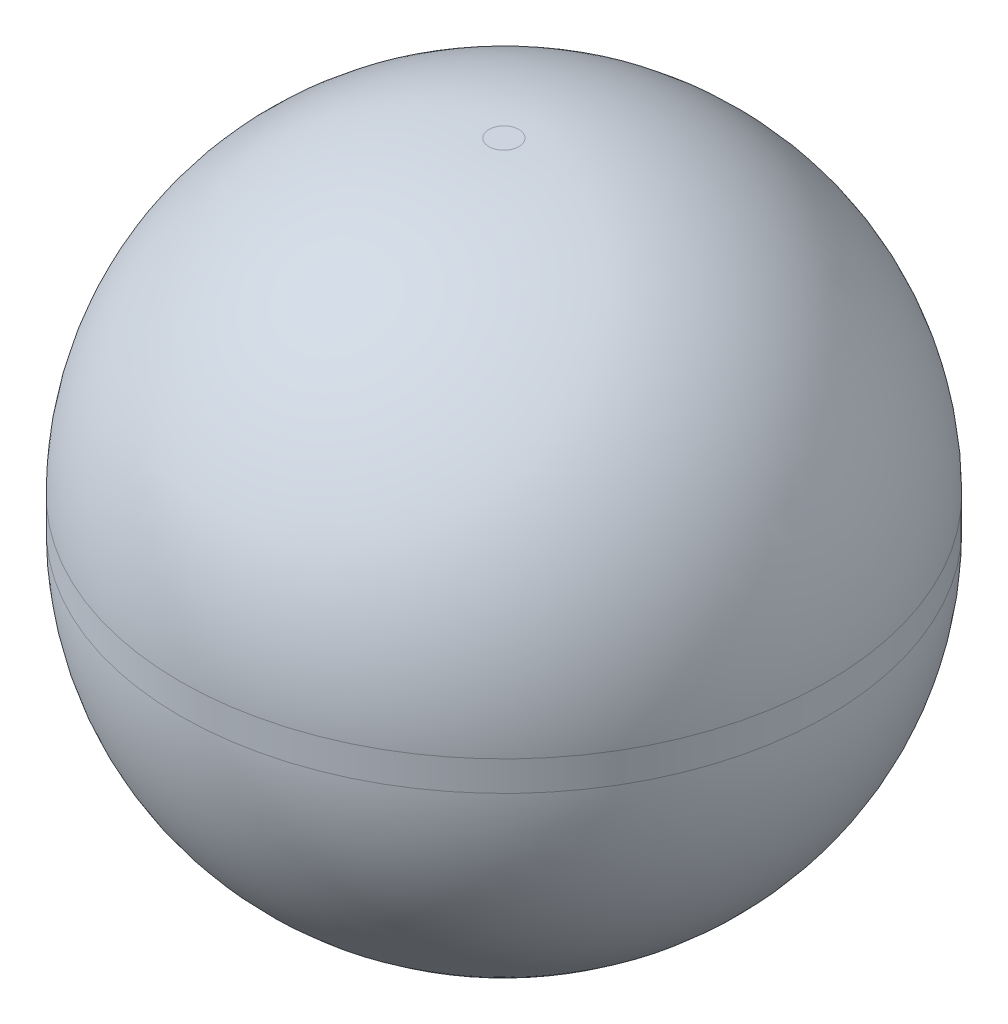
ISO-10303-21;
HEADER;
FILE_DESCRIPTION(('STEP AP214'),'2;1');
FILE_NAME('part.step','',(''),(''),'','','');
FILE_SCHEMA(('AUTOMOTIVE_DESIGN { 1 0 10303 214 1 1 1 1 }'));
ENDSEC;
DATA;
#1=APPLICATION_CONTEXT('core data for automotive mechanical design processes');
#2=APPLICATION_PROTOCOL_DEFINITION('international standard','automotive_design',2000,#1);
#3=PRODUCT_CONTEXT('',#1,'mechanical');
#4=PRODUCT('Part','Part','',(#3));
#5=PRODUCT_RELATED_PRODUCT_CATEGORY('part','',(#4));
#6=PRODUCT_DEFINITION_FORMATION('','',#4);
#7=PRODUCT_DEFINITION_CONTEXT('part definition',#1,'design');
#8=PRODUCT_DEFINITION('design','',#6,#7);
#9=PRODUCT_DEFINITION_SHAPE('','',#8);
#10=(LENGTH_UNIT() NAMED_UNIT(*) SI_UNIT(.MILLI.,.METRE.));
#11=(NAMED_UNIT(*) PLANE_ANGLE_UNIT() SI_UNIT($,.RADIAN.));
#12=(NAMED_UNIT(*) SI_UNIT($,.STERADIAN.) SOLID_ANGLE_UNIT());
#13=UNCERTAINTY_MEASURE_WITH_UNIT(LENGTH_MEASURE(1.E-05),#10,'distance_accuracy_value','');
#14=(GEOMETRIC_REPRESENTATION_CONTEXT(3) GLOBAL_UNCERTAINTY_ASSIGNED_CONTEXT((#13)) GLOBAL_UNIT_ASSIGNED_CONTEXT((#10,
#11,#12)) REPRESENTATION_CONTEXT('',''));
#15=CARTESIAN_POINT('',(0.,0.,0.));
#16=DIRECTION('',(0.,0.,1.));
#17=DIRECTION('',(1.,0.,0.));
#18=AXIS2_PLACEMENT_3D('',#15,#16,#17);
#19=CARTESIAN_POINT('',(0.,65.,0.));
#20=DIRECTION('',(0.,-1.,0.));
#21=DIRECTION('',(0.,0.,-1.));
#22=AXIS2_PLACEMENT_3D('',#19,#20,#21);
#23=CYLINDRICAL_SURFACE('',#22,32.5);
#24=CARTESIAN_POINT('',(0.,31.,0.));
#25=DIRECTION('',(0.,1.,0.));
#26=DIRECTION('',(0.,0.,1.));
#27=AXIS2_PLACEMENT_3D('',#24,#25,#26);
#28=CIRCLE('',#27,32.5);
#29=CARTESIAN_POINT('',(0.,31.,32.5));
#30=VERTEX_POINT('',#29);
#31=EDGE_CURVE('E45',#30,#30,#28,.T.);
#32=ORIENTED_EDGE('',*,*,#31,.T.);
#33=EDGE_LOOP('',(#32));
#34=FACE_BOUND('',#33,.T.);
#35=CARTESIAN_POINT('',(0.,34.,0.));
#36=DIRECTION('',(0.,1.,0.));
#37=DIRECTION('',(0.,0.,1.));
#38=AXIS2_PLACEMENT_3D('',#35,#36,#37);
#39=CIRCLE('',#38,32.5);
#40=CARTESIAN_POINT('',(0.,34.,32.5));
#41=VERTEX_POINT('',#40);
#42=EDGE_CURVE('E49',#41,#41,#39,.F.);
#43=ORIENTED_EDGE('',*,*,#42,.T.);
#44=EDGE_LOOP('',(#43));
#45=FACE_BOUND('',#44,.T.);
#46=ADVANCED_FACE('F34',(#34,#45),#23,.T.);
#47=CARTESIAN_POINT('',(0.,65.,0.));
#48=DIRECTION('',(0.,1.,0.));
#49=DIRECTION('',(0.,0.,1.));
#50=AXIS2_PLACEMENT_3D('',#47,#48,#49);
#51=PLANE('',#50);
#52=CARTESIAN_POINT('',(0.,65.,0.));
#53=DIRECTION('',(0.,1.,0.));
#54=DIRECTION('',(0.,0.,1.));
#55=AXIS2_PLACEMENT_3D('',#52,#53,#54);
#56=CIRCLE('',#55,1.5);
#57=CARTESIAN_POINT('',(0.,65.,1.5));
#58=VERTEX_POINT('',#57);
#59=EDGE_CURVE('E11',#58,#58,#56,.T.);
#60=ORIENTED_EDGE('',*,*,#59,.T.);
#61=EDGE_LOOP('',(#60));
#62=FACE_BOUND('',#61,.T.);
#63=ADVANCED_FACE('F65',(#62),#51,.T.);
#64=CARTESIAN_POINT('',(0.,0.,0.));
#65=DIRECTION('',(0.,1.,0.));
#66=DIRECTION('',(0.,0.,1.));
#67=AXIS2_PLACEMENT_3D('',#64,#65,#66);
#68=PLANE('',#67);
#69=CARTESIAN_POINT('',(0.,0.,0.));
#70=DIRECTION('',(0.,1.,0.));
#71=DIRECTION('',(0.,0.,1.));
#72=AXIS2_PLACEMENT_3D('',#69,#70,#71);
#73=CIRCLE('',#72,1.5);
#74=CARTESIAN_POINT('',(0.,0.,1.5));
#75=VERTEX_POINT('',#74);
#76=EDGE_CURVE('E41',#75,#75,#73,.F.);
#77=ORIENTED_EDGE('',*,*,#76,.T.);
#78=EDGE_LOOP('',(#77));
#79=FACE_BOUND('',#78,.T.);
#80=ADVANCED_FACE('F62',(#79),#68,.F.);
#81=CARTESIAN_POINT('',(0.,31.,0.));
#82=DIRECTION('',(0.,1.,0.));
#83=DIRECTION('',(0.,0.,1.));
#84=AXIS2_PLACEMENT_3D('',#81,#82,#83);
#85=DEGENERATE_TOROIDAL_SURFACE('',#84,1.5,31.,.T.);
#86=ORIENTED_EDGE('',*,*,#76,.F.);
#87=EDGE_LOOP('',(#86));
#88=FACE_BOUND('',#87,.T.);
#89=ORIENTED_EDGE('',*,*,#31,.F.);
#90=EDGE_LOOP('',(#89));
#91=FACE_BOUND('',#90,.T.);
#92=ADVANCED_FACE('F58',(#88,#91),#85,.T.);
#93=CARTESIAN_POINT('',(0.,34.,0.));
#94=DIRECTION('',(0.,1.,0.));
#95=DIRECTION('',(0.,0.,1.));
#96=AXIS2_PLACEMENT_3D('',#93,#94,#95);
#97=DEGENERATE_TOROIDAL_SURFACE('',#96,1.5,31.,.T.);
#98=ORIENTED_EDGE('',*,*,#42,.F.);
#99=EDGE_LOOP('',(#98));
#100=FACE_BOUND('',#99,.T.);
#101=ORIENTED_EDGE('',*,*,#59,.F.);
#102=EDGE_LOOP('',(#101));
#103=FACE_BOUND('',#102,.T.);
#104=ADVANCED_FACE('F36',(#100,#103),#97,.T.);
#105=CLOSED_SHELL('',(#46,#63,#80,#92,#104));
#106=MANIFOLD_SOLID_BREP('B2',#105);
#107=ADVANCED_BREP_SHAPE_REPRESENTATION('',(#18,#106),#14);
#108=SHAPE_DEFINITION_REPRESENTATION(#9,#107);
ENDSEC;
END-ISO-10303-21;
